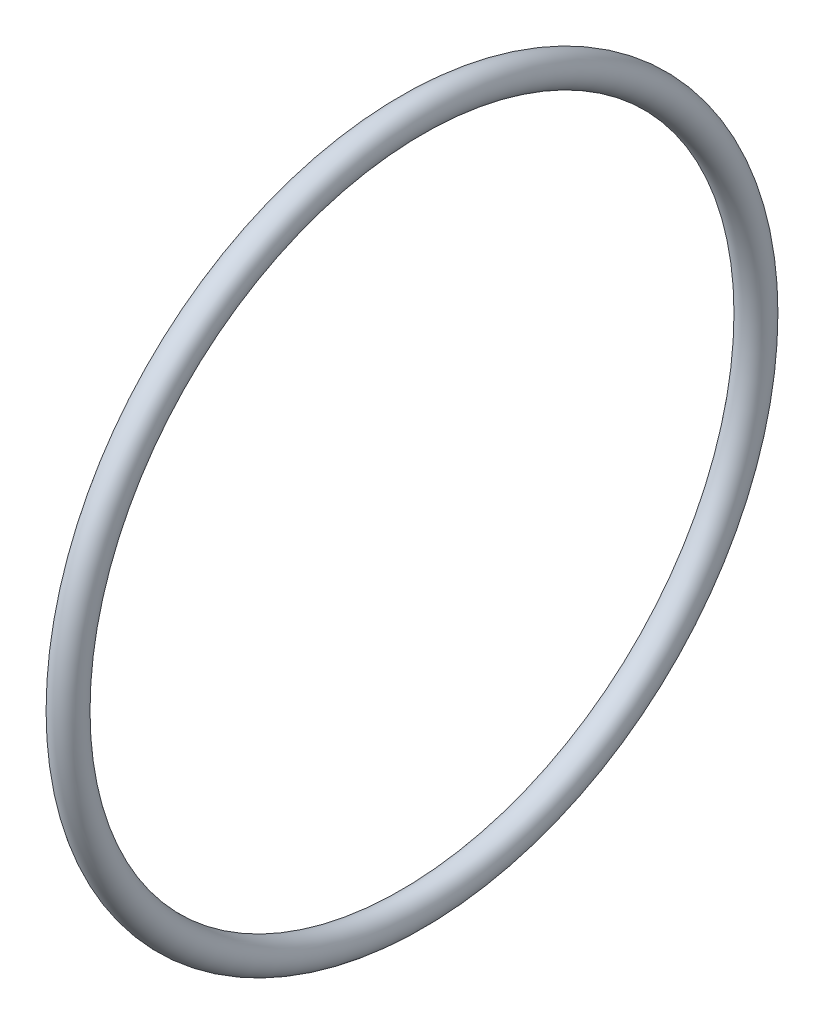
ISO-10303-21;
HEADER;
FILE_DESCRIPTION(('STEP AP214'),'2;1');
FILE_NAME('part.step','',(''),(''),'','','');
FILE_SCHEMA(('AUTOMOTIVE_DESIGN { 1 0 10303 214 1 1 1 1 }'));
ENDSEC;
DATA;
#1=APPLICATION_CONTEXT('core data for automotive mechanical design processes');
#2=APPLICATION_PROTOCOL_DEFINITION('international standard','automotive_design',2000,#1);
#3=PRODUCT_CONTEXT('',#1,'mechanical');
#4=PRODUCT('Part','Part','',(#3));
#5=PRODUCT_RELATED_PRODUCT_CATEGORY('part','',(#4));
#6=PRODUCT_DEFINITION_FORMATION('','',#4);
#7=PRODUCT_DEFINITION_CONTEXT('part definition',#1,'design');
#8=PRODUCT_DEFINITION('design','',#6,#7);
#9=PRODUCT_DEFINITION_SHAPE('','',#8);
#10=(LENGTH_UNIT() NAMED_UNIT(*) SI_UNIT(.MILLI.,.METRE.));
#11=(NAMED_UNIT(*) PLANE_ANGLE_UNIT() SI_UNIT($,.RADIAN.));
#12=(NAMED_UNIT(*) SI_UNIT($,.STERADIAN.) SOLID_ANGLE_UNIT());
#13=UNCERTAINTY_MEASURE_WITH_UNIT(LENGTH_MEASURE(1.E-05),#10,'distance_accuracy_value','');
#14=(GEOMETRIC_REPRESENTATION_CONTEXT(3) GLOBAL_UNCERTAINTY_ASSIGNED_CONTEXT((#13)) GLOBAL_UNIT_ASSIGNED_CONTEXT((#10,
#11,#12)) REPRESENTATION_CONTEXT('',''));
#15=CARTESIAN_POINT('',(0.,0.,0.));
#16=DIRECTION('',(0.,0.,1.));
#17=DIRECTION('',(1.,0.,0.));
#18=AXIS2_PLACEMENT_3D('',#15,#16,#17);
#19=CARTESIAN_POINT('',(2.54,0.,0.));
#20=DIRECTION('',(-1.,0.,0.));
#21=DIRECTION('',(0.,0.,1.));
#22=AXIS2_PLACEMENT_3D('',#19,#20,#21);
#23=TOROIDAL_SURFACE('',#22,22.479,1.016);
#24=CARTESIAN_POINT('',(2.54,0.,23.495));
#25=VERTEX_POINT('',#24);
#26=VERTEX_LOOP('',#25);
#27=FACE_BOUND('',#26,.T.);
#28=ADVANCED_FACE('F31',(#27),#23,.T.);
#29=CLOSED_SHELL('',(#28));
#30=MANIFOLD_SOLID_BREP('B2',#29);
#31=ADVANCED_BREP_SHAPE_REPRESENTATION('',(#18,#30),#14);
#32=SHAPE_DEFINITION_REPRESENTATION(#9,#31);
ENDSEC;
END-ISO-10303-21;
